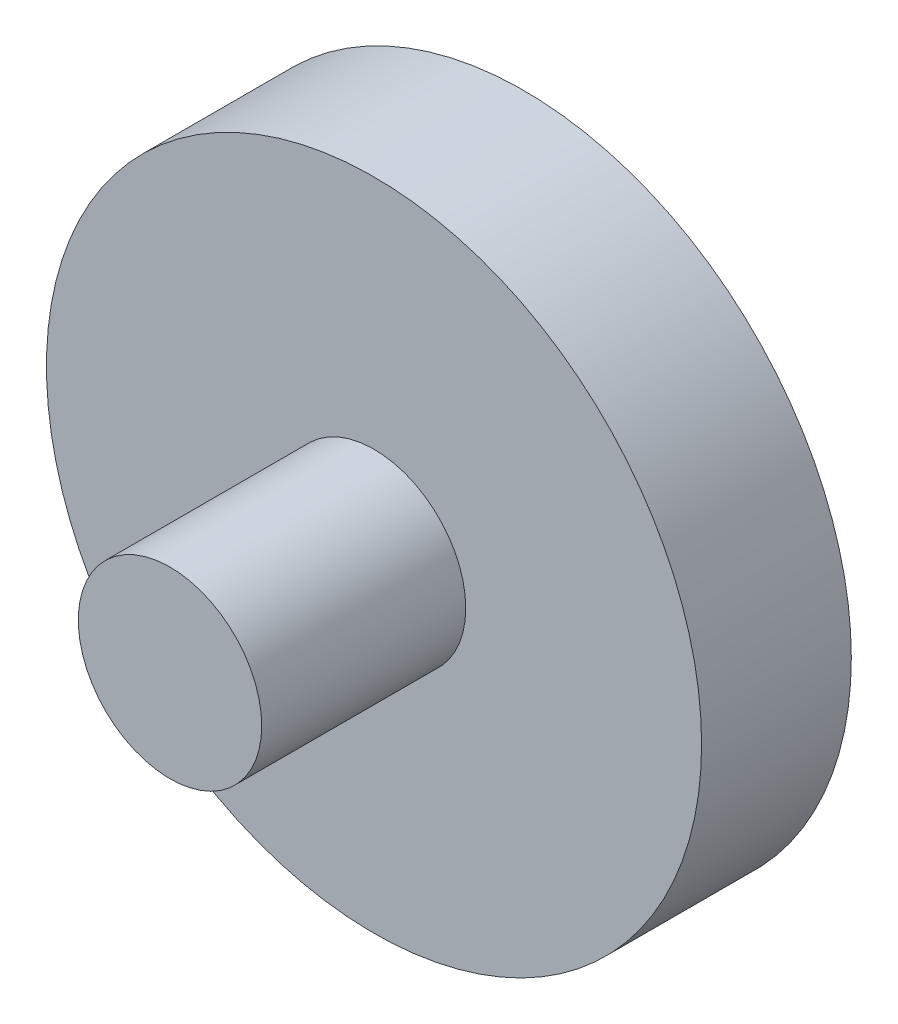
ISO-10303-21;
HEADER;
FILE_DESCRIPTION(('STEP AP214'),'2;1');
FILE_NAME('part.step','',(''),(''),'','','');
FILE_SCHEMA(('AUTOMOTIVE_DESIGN { 1 0 10303 214 1 1 1 1 }'));
ENDSEC;
DATA;
#1=APPLICATION_CONTEXT('core data for automotive mechanical design processes');
#2=APPLICATION_PROTOCOL_DEFINITION('international standard','automotive_design',2000,#1);
#3=PRODUCT_CONTEXT('',#1,'mechanical');
#4=PRODUCT('Part','Part','',(#3));
#5=PRODUCT_RELATED_PRODUCT_CATEGORY('part','',(#4));
#6=PRODUCT_DEFINITION_FORMATION('','',#4);
#7=PRODUCT_DEFINITION_CONTEXT('part definition',#1,'design');
#8=PRODUCT_DEFINITION('design','',#6,#7);
#9=PRODUCT_DEFINITION_SHAPE('','',#8);
#10=(LENGTH_UNIT() NAMED_UNIT(*) SI_UNIT(.MILLI.,.METRE.));
#11=(NAMED_UNIT(*) PLANE_ANGLE_UNIT() SI_UNIT($,.RADIAN.));
#12=(NAMED_UNIT(*) SI_UNIT($,.STERADIAN.) SOLID_ANGLE_UNIT());
#13=UNCERTAINTY_MEASURE_WITH_UNIT(LENGTH_MEASURE(1.E-05),#10,'distance_accuracy_value','');
#14=(GEOMETRIC_REPRESENTATION_CONTEXT(3) GLOBAL_UNCERTAINTY_ASSIGNED_CONTEXT((#13)) GLOBAL_UNIT_ASSIGNED_CONTEXT((#10,
#11,#12)) REPRESENTATION_CONTEXT('',''));
#15=CARTESIAN_POINT('',(0.,0.,0.));
#16=DIRECTION('',(0.,0.,1.));
#17=DIRECTION('',(1.,0.,0.));
#18=AXIS2_PLACEMENT_3D('',#15,#16,#17);
#19=CARTESIAN_POINT('',(0.,0.,8.));
#20=DIRECTION('',(0.,0.,-1.));
#21=DIRECTION('',(-1.,0.,0.));
#22=AXIS2_PLACEMENT_3D('',#19,#20,#21);
#23=CYLINDRICAL_SURFACE('',#22,17.5);
#24=CARTESIAN_POINT('',(0.,0.,8.));
#25=DIRECTION('',(0.,0.,1.));
#26=DIRECTION('',(1.,0.,0.));
#27=AXIS2_PLACEMENT_3D('',#24,#25,#26);
#28=CIRCLE('',#27,17.5);
#29=CARTESIAN_POINT('',(17.5,0.,8.));
#30=VERTEX_POINT('',#29);
#31=EDGE_CURVE('E45',#30,#30,#28,.T.);
#32=ORIENTED_EDGE('',*,*,#31,.F.);
#33=EDGE_LOOP('',(#32));
#34=FACE_BOUND('',#33,.T.);
#35=CARTESIAN_POINT('',(0.,0.,0.));
#36=DIRECTION('',(0.,0.,1.));
#37=DIRECTION('',(1.,0.,0.));
#38=AXIS2_PLACEMENT_3D('',#35,#36,#37);
#39=CIRCLE('',#38,17.5);
#40=CARTESIAN_POINT('',(17.5,0.,0.));
#41=VERTEX_POINT('',#40);
#42=EDGE_CURVE('E40',#41,#41,#39,.T.);
#43=ORIENTED_EDGE('',*,*,#42,.T.);
#44=EDGE_LOOP('',(#43));
#45=FACE_BOUND('',#44,.T.);
#46=ADVANCED_FACE('F37',(#34,#45),#23,.T.);
#47=CARTESIAN_POINT('',(0.,0.,8.));
#48=DIRECTION('',(0.,0.,1.));
#49=DIRECTION('',(1.,0.,0.));
#50=AXIS2_PLACEMENT_3D('',#47,#48,#49);
#51=PLANE('',#50);
#52=CARTESIAN_POINT('',(0.,0.,8.));
#53=DIRECTION('',(0.,0.,1.));
#54=DIRECTION('',(1.,0.,0.));
#55=AXIS2_PLACEMENT_3D('',#52,#53,#54);
#56=CIRCLE('',#55,4.9);
#57=CARTESIAN_POINT('',(4.9,0.,8.));
#58=VERTEX_POINT('',#57);
#59=EDGE_CURVE('E10',#58,#58,#56,.T.);
#60=ORIENTED_EDGE('',*,*,#59,.F.);
#61=EDGE_LOOP('',(#60));
#62=FACE_BOUND('',#61,.T.);
#63=ORIENTED_EDGE('',*,*,#31,.T.);
#64=EDGE_LOOP('',(#63));
#65=FACE_BOUND('',#64,.T.);
#66=ADVANCED_FACE('F65',(#62,#65),#51,.T.);
#67=CARTESIAN_POINT('',(0.,0.,0.));
#68=DIRECTION('',(0.,0.,1.));
#69=DIRECTION('',(1.,0.,0.));
#70=AXIS2_PLACEMENT_3D('',#67,#68,#69);
#71=PLANE('',#70);
#72=ORIENTED_EDGE('',*,*,#42,.F.);
#73=EDGE_LOOP('',(#72));
#74=FACE_BOUND('',#73,.T.);
#75=ADVANCED_FACE('F62',(#74),#71,.F.);
#76=CARTESIAN_POINT('',(0.,0.,18.9));
#77=DIRECTION('',(0.,0.,-1.));
#78=DIRECTION('',(-1.,0.,0.));
#79=AXIS2_PLACEMENT_3D('',#76,#77,#78);
#80=CYLINDRICAL_SURFACE('',#79,4.9);
#81=CARTESIAN_POINT('',(0.,0.,18.9));
#82=DIRECTION('',(0.,0.,1.));
#83=DIRECTION('',(1.,0.,0.));
#84=AXIS2_PLACEMENT_3D('',#81,#82,#83);
#85=CIRCLE('',#84,4.9);
#86=CARTESIAN_POINT('',(4.9,0.,18.9));
#87=VERTEX_POINT('',#86);
#88=EDGE_CURVE('E52',#87,#87,#85,.T.);
#89=ORIENTED_EDGE('',*,*,#88,.F.);
#90=EDGE_LOOP('',(#89));
#91=FACE_BOUND('',#90,.T.);
#92=ORIENTED_EDGE('',*,*,#59,.T.);
#93=EDGE_LOOP('',(#92));
#94=FACE_BOUND('',#93,.T.);
#95=ADVANCED_FACE('F64',(#91,#94),#80,.T.);
#96=CARTESIAN_POINT('',(0.,0.,18.9));
#97=DIRECTION('',(0.,0.,1.));
#98=DIRECTION('',(1.,0.,0.));
#99=AXIS2_PLACEMENT_3D('',#96,#97,#98);
#100=PLANE('',#99);
#101=ORIENTED_EDGE('',*,*,#88,.T.);
#102=EDGE_LOOP('',(#101));
#103=FACE_BOUND('',#102,.T.);
#104=ADVANCED_FACE('F70',(#103),#100,.T.);
#105=CLOSED_SHELL('',(#46,#66,#75,#95,#104));
#106=MANIFOLD_SOLID_BREP('B2',#105);
#107=ADVANCED_BREP_SHAPE_REPRESENTATION('',(#18,#106),#14);
#108=SHAPE_DEFINITION_REPRESENTATION(#9,#107);
ENDSEC;
END-ISO-10303-21;
